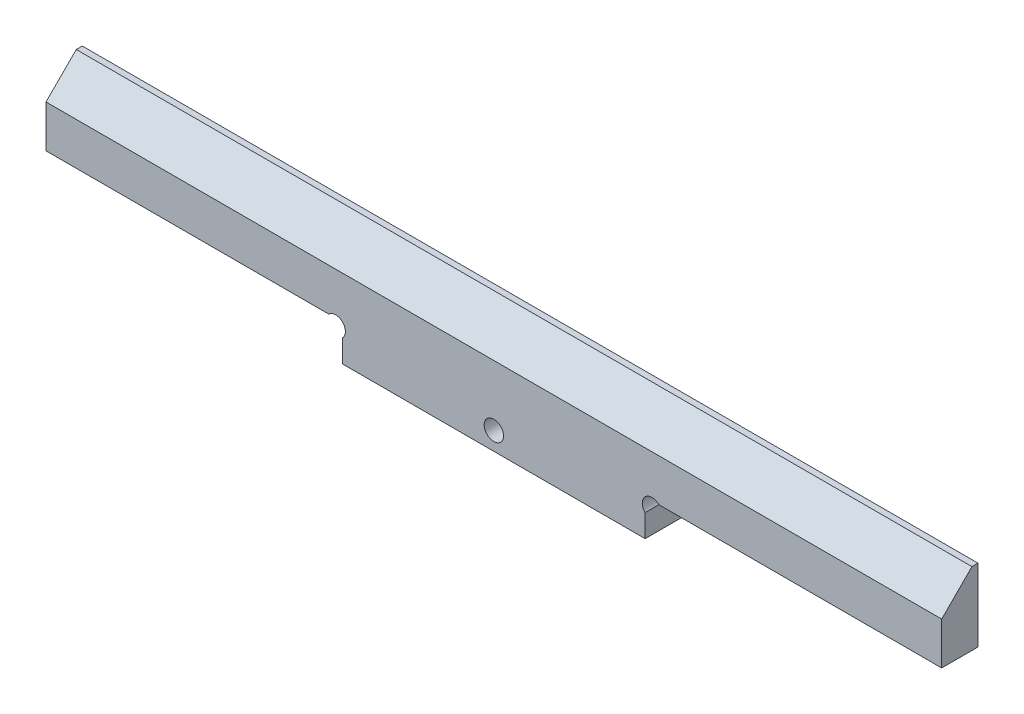
ISO-10303-21;
HEADER;
FILE_DESCRIPTION(('STEP AP214'),'2;1');
FILE_NAME('part.step','',(''),(''),'','','');
FILE_SCHEMA(('AUTOMOTIVE_DESIGN { 1 0 10303 214 1 1 1 1 }'));
ENDSEC;
DATA;
#1=APPLICATION_CONTEXT('core data for automotive mechanical design processes');
#2=APPLICATION_PROTOCOL_DEFINITION('international standard','automotive_design',2000,#1);
#3=PRODUCT_CONTEXT('',#1,'mechanical');
#4=PRODUCT('Part','Part','',(#3));
#5=PRODUCT_RELATED_PRODUCT_CATEGORY('part','',(#4));
#6=PRODUCT_DEFINITION_FORMATION('','',#4);
#7=PRODUCT_DEFINITION_CONTEXT('part definition',#1,'design');
#8=PRODUCT_DEFINITION('design','',#6,#7);
#9=PRODUCT_DEFINITION_SHAPE('','',#8);
#10=(LENGTH_UNIT() NAMED_UNIT(*) SI_UNIT(.MILLI.,.METRE.));
#11=(NAMED_UNIT(*) PLANE_ANGLE_UNIT() SI_UNIT($,.RADIAN.));
#12=(NAMED_UNIT(*) SI_UNIT($,.STERADIAN.) SOLID_ANGLE_UNIT());
#13=UNCERTAINTY_MEASURE_WITH_UNIT(LENGTH_MEASURE(1.E-05),#10,'distance_accuracy_value','');
#14=(GEOMETRIC_REPRESENTATION_CONTEXT(3) GLOBAL_UNCERTAINTY_ASSIGNED_CONTEXT((#13)) GLOBAL_UNIT_ASSIGNED_CONTEXT((#10,
#11,#12)) REPRESENTATION_CONTEXT('',''));
#15=CARTESIAN_POINT('',(0.,0.,0.));
#16=DIRECTION('',(0.,0.,1.));
#17=DIRECTION('',(1.,0.,0.));
#18=AXIS2_PLACEMENT_3D('',#15,#16,#17);
#19=CARTESIAN_POINT('',(47.8686291501015,4.86862915010152,6.));
#20=DIRECTION('',(0.,0.,1.));
#21=DIRECTION('',(1.,0.,0.));
#22=AXIS2_PLACEMENT_3D('',#19,#20,#21);
#23=PLANE('',#22);
#24=DIRECTION('',(-1.,0.,0.));
#25=VECTOR('',#24,1.);
#26=CARTESIAN_POINT('',(148.,13.,6.));
#27=LINE('',#26,#25);
#28=CARTESIAN_POINT('',(148.,13.,6.));
#29=VERTEX_POINT('',#28);
#30=CARTESIAN_POINT('',(0.,13.,6.));
#31=VERTEX_POINT('',#30);
#32=EDGE_CURVE('E216',#29,#31,#27,.T.);
#33=ORIENTED_EDGE('',*,*,#32,.T.);
#34=DIRECTION('',(0.,-1.,0.));
#35=VECTOR('',#34,1.);
#36=CARTESIAN_POINT('',(0.,6.,6.));
#37=LINE('',#36,#35);
#38=CARTESIAN_POINT('',(0.,6.,6.));
#39=VERTEX_POINT('',#38);
#40=EDGE_CURVE('E147',#31,#39,#37,.T.);
#41=ORIENTED_EDGE('',*,*,#40,.T.);
#42=DIRECTION('',(1.,0.,0.));
#43=VECTOR('',#42,1.);
#44=CARTESIAN_POINT('',(46.7372583002031,6.,6.));
#45=LINE('',#44,#43);
#46=CARTESIAN_POINT('',(46.7372583002031,6.,6.));
#47=VERTEX_POINT('',#46);
#48=EDGE_CURVE('E56',#39,#47,#45,.T.);
#49=ORIENTED_EDGE('',*,*,#48,.T.);
#50=CARTESIAN_POINT('',(47.8686291501015,4.86862915010152,6.));
#51=DIRECTION('',(0.,0.,-1.));
#52=DIRECTION('',(1.,0.,0.));
#53=AXIS2_PLACEMENT_3D('',#50,#51,#52);
#54=CIRCLE('',#53,1.6);
#55=CARTESIAN_POINT('',(49.,3.73725830020303,6.));
#56=VERTEX_POINT('',#55);
#57=EDGE_CURVE('E175',#47,#56,#54,.T.);
#58=ORIENTED_EDGE('',*,*,#57,.T.);
#59=DIRECTION('',(0.,-1.,0.));
#60=VECTOR('',#59,1.);
#61=CARTESIAN_POINT('',(49.,3.73725830020303,6.));
#62=LINE('',#61,#60);
#63=CARTESIAN_POINT('',(49.,0.,6.));
#64=VERTEX_POINT('',#63);
#65=EDGE_CURVE('E103',#56,#64,#62,.T.);
#66=ORIENTED_EDGE('',*,*,#65,.T.);
#67=DIRECTION('',(1.,0.,0.));
#68=VECTOR('',#67,1.);
#69=CARTESIAN_POINT('',(49.,0.,6.));
#70=LINE('',#69,#68);
#71=CARTESIAN_POINT('',(99.,0.,6.));
#72=VERTEX_POINT('',#71);
#73=EDGE_CURVE('E194',#64,#72,#70,.T.);
#74=ORIENTED_EDGE('',*,*,#73,.T.);
#75=DIRECTION('',(0.,1.,0.));
#76=VECTOR('',#75,1.);
#77=CARTESIAN_POINT('',(99.,0.,6.));
#78=LINE('',#77,#76);
#79=CARTESIAN_POINT('',(99.,3.73725830020303,6.));
#80=VERTEX_POINT('',#79);
#81=EDGE_CURVE('E207',#72,#80,#78,.T.);
#82=ORIENTED_EDGE('',*,*,#81,.T.);
#83=CARTESIAN_POINT('',(100.131370849898,4.86862915010152,6.));
#84=DIRECTION('',(0.,0.,-1.));
#85=DIRECTION('',(-1.,0.,0.));
#86=AXIS2_PLACEMENT_3D('',#83,#84,#85);
#87=CIRCLE('',#86,1.6);
#88=CARTESIAN_POINT('',(101.262741699797,6.,6.));
#89=VERTEX_POINT('',#88);
#90=EDGE_CURVE('E127',#80,#89,#87,.T.);
#91=ORIENTED_EDGE('',*,*,#90,.T.);
#92=DIRECTION('',(1.,0.,0.));
#93=VECTOR('',#92,1.);
#94=CARTESIAN_POINT('',(148.,6.,6.));
#95=LINE('',#94,#93);
#96=CARTESIAN_POINT('',(148.,6.,6.));
#97=VERTEX_POINT('',#96);
#98=EDGE_CURVE('E120',#89,#97,#95,.T.);
#99=ORIENTED_EDGE('',*,*,#98,.T.);
#100=DIRECTION('',(0.,1.,0.));
#101=VECTOR('',#100,1.);
#102=CARTESIAN_POINT('',(148.,18.,6.));
#103=LINE('',#102,#101);
#104=EDGE_CURVE('E125',#97,#29,#103,.T.);
#105=ORIENTED_EDGE('',*,*,#104,.T.);
#106=EDGE_LOOP('',(#33,#41,#49,#58,#66,#74,#82,#91,#99,#105));
#107=FACE_BOUND('',#106,.T.);
#108=CARTESIAN_POINT('',(74.,3.,6.));
#109=DIRECTION('',(0.,0.,1.));
#110=DIRECTION('',(1.,0.,0.));
#111=AXIS2_PLACEMENT_3D('',#108,#109,#110);
#112=CIRCLE('',#111,1.60000000000001);
#113=CARTESIAN_POINT('',(75.6,3.,6.));
#114=VERTEX_POINT('',#113);
#115=EDGE_CURVE('E158',#114,#114,#112,.T.);
#116=ORIENTED_EDGE('',*,*,#115,.F.);
#117=EDGE_LOOP('',(#116));
#118=FACE_BOUND('',#117,.T.);
#119=ADVANCED_FACE('F32',(#107,#118),#23,.T.);
#120=CARTESIAN_POINT('',(47.8686291501015,4.86862915010152,0.));
#121=DIRECTION('',(0.,0.,1.));
#122=DIRECTION('',(1.,0.,0.));
#123=AXIS2_PLACEMENT_3D('',#120,#121,#122);
#124=PLANE('',#123);
#125=CARTESIAN_POINT('',(47.8686291501015,4.86862915010152,0.));
#126=DIRECTION('',(0.,0.,-1.));
#127=DIRECTION('',(1.,0.,0.));
#128=AXIS2_PLACEMENT_3D('',#125,#126,#127);
#129=CIRCLE('',#128,1.6);
#130=CARTESIAN_POINT('',(46.7372583002031,6.,0.));
#131=VERTEX_POINT('',#130);
#132=CARTESIAN_POINT('',(49.,3.73725830020303,0.));
#133=VERTEX_POINT('',#132);
#134=EDGE_CURVE('E154',#131,#133,#129,.T.);
#135=ORIENTED_EDGE('',*,*,#134,.F.);
#136=DIRECTION('',(1.,0.,0.));
#137=VECTOR('',#136,1.);
#138=CARTESIAN_POINT('',(46.7372583002031,6.,0.));
#139=LINE('',#138,#137);
#140=CARTESIAN_POINT('',(0.,6.,0.));
#141=VERTEX_POINT('',#140);
#142=EDGE_CURVE('E95',#141,#131,#139,.T.);
#143=ORIENTED_EDGE('',*,*,#142,.F.);
#144=DIRECTION('',(0.,-1.,0.));
#145=VECTOR('',#144,1.);
#146=CARTESIAN_POINT('',(0.,6.,0.));
#147=LINE('',#146,#145);
#148=CARTESIAN_POINT('',(0.,18.,0.));
#149=VERTEX_POINT('',#148);
#150=EDGE_CURVE('E172',#149,#141,#147,.T.);
#151=ORIENTED_EDGE('',*,*,#150,.F.);
#152=DIRECTION('',(-1.,0.,0.));
#153=VECTOR('',#152,1.);
#154=CARTESIAN_POINT('',(0.,18.,0.));
#155=LINE('',#154,#153);
#156=CARTESIAN_POINT('',(148.,18.,0.));
#157=VERTEX_POINT('',#156);
#158=EDGE_CURVE('E169',#157,#149,#155,.T.);
#159=ORIENTED_EDGE('',*,*,#158,.F.);
#160=DIRECTION('',(0.,1.,0.));
#161=VECTOR('',#160,1.);
#162=CARTESIAN_POINT('',(148.,18.,0.));
#163=LINE('',#162,#161);
#164=CARTESIAN_POINT('',(148.,6.,0.));
#165=VERTEX_POINT('',#164);
#166=EDGE_CURVE('E167',#165,#157,#163,.T.);
#167=ORIENTED_EDGE('',*,*,#166,.F.);
#168=DIRECTION('',(1.,0.,0.));
#169=VECTOR('',#168,1.);
#170=CARTESIAN_POINT('',(148.,6.,0.));
#171=LINE('',#170,#169);
#172=CARTESIAN_POINT('',(101.262741699797,6.,0.));
#173=VERTEX_POINT('',#172);
#174=EDGE_CURVE('E136',#173,#165,#171,.T.);
#175=ORIENTED_EDGE('',*,*,#174,.F.);
#176=CARTESIAN_POINT('',(100.131370849898,4.86862915010152,0.));
#177=DIRECTION('',(0.,0.,-1.));
#178=DIRECTION('',(-1.,0.,0.));
#179=AXIS2_PLACEMENT_3D('',#176,#177,#178);
#180=CIRCLE('',#179,1.6);
#181=CARTESIAN_POINT('',(99.,3.73725830020303,0.));
#182=VERTEX_POINT('',#181);
#183=EDGE_CURVE('E164',#182,#173,#180,.T.);
#184=ORIENTED_EDGE('',*,*,#183,.F.);
#185=DIRECTION('',(0.,1.,0.));
#186=VECTOR('',#185,1.);
#187=CARTESIAN_POINT('',(99.,0.,0.));
#188=LINE('',#187,#186);
#189=CARTESIAN_POINT('',(99.,0.,0.));
#190=VERTEX_POINT('',#189);
#191=EDGE_CURVE('E162',#190,#182,#188,.T.);
#192=ORIENTED_EDGE('',*,*,#191,.F.);
#193=DIRECTION('',(1.,0.,0.));
#194=VECTOR('',#193,1.);
#195=CARTESIAN_POINT('',(49.,0.,0.));
#196=LINE('',#195,#194);
#197=CARTESIAN_POINT('',(49.,0.,0.));
#198=VERTEX_POINT('',#197);
#199=EDGE_CURVE('E160',#198,#190,#196,.T.);
#200=ORIENTED_EDGE('',*,*,#199,.F.);
#201=DIRECTION('',(0.,-1.,0.));
#202=VECTOR('',#201,1.);
#203=CARTESIAN_POINT('',(49.,3.73725830020303,0.));
#204=LINE('',#203,#202);
#205=EDGE_CURVE('E157',#133,#198,#204,.T.);
#206=ORIENTED_EDGE('',*,*,#205,.F.);
#207=EDGE_LOOP('',(#135,#143,#151,#159,#167,#175,#184,#192,#200,#206));
#208=FACE_BOUND('',#207,.T.);
#209=CARTESIAN_POINT('',(74.,3.,0.));
#210=DIRECTION('',(0.,0.,1.));
#211=DIRECTION('',(1.,0.,0.));
#212=AXIS2_PLACEMENT_3D('',#209,#210,#211);
#213=CIRCLE('',#212,1.60000000000001);
#214=CARTESIAN_POINT('',(75.6,3.,0.));
#215=VERTEX_POINT('',#214);
#216=EDGE_CURVE('E213',#215,#215,#213,.T.);
#217=ORIENTED_EDGE('',*,*,#216,.T.);
#218=EDGE_LOOP('',(#217));
#219=FACE_BOUND('',#218,.T.);
#220=ADVANCED_FACE('F198',(#208,#219),#124,.F.);
#221=CARTESIAN_POINT('',(47.8686291501015,4.86862915010152,6.));
#222=DIRECTION('',(0.,0.,-1.));
#223=DIRECTION('',(-1.,0.,0.));
#224=AXIS2_PLACEMENT_3D('',#221,#222,#223);
#225=CYLINDRICAL_SURFACE('',#224,1.6);
#226=ORIENTED_EDGE('',*,*,#134,.T.);
#227=DIRECTION('',(0.,0.,-1.));
#228=VECTOR('',#227,1.);
#229=CARTESIAN_POINT('',(49.,3.73725830020303,6.));
#230=LINE('',#229,#228);
#231=EDGE_CURVE('E11',#56,#133,#230,.T.);
#232=ORIENTED_EDGE('',*,*,#231,.F.);
#233=ORIENTED_EDGE('',*,*,#57,.F.);
#234=DIRECTION('',(0.,0.,-1.));
#235=VECTOR('',#234,1.);
#236=CARTESIAN_POINT('',(46.7372583002031,6.,6.));
#237=LINE('',#236,#235);
#238=EDGE_CURVE('E153',#47,#131,#237,.T.);
#239=ORIENTED_EDGE('',*,*,#238,.T.);
#240=EDGE_LOOP('',(#226,#232,#233,#239));
#241=FACE_BOUND('',#240,.T.);
#242=ADVANCED_FACE('F34',(#241),#225,.F.);
#243=CARTESIAN_POINT('',(49.,3.73725830020303,6.));
#244=DIRECTION('',(1.,0.,0.));
#245=DIRECTION('',(0.,0.,-1.));
#246=AXIS2_PLACEMENT_3D('',#243,#244,#245);
#247=PLANE('',#246);
#248=ORIENTED_EDGE('',*,*,#205,.T.);
#249=DIRECTION('',(0.,0.,-1.));
#250=VECTOR('',#249,1.);
#251=CARTESIAN_POINT('',(49.,0.,6.));
#252=LINE('',#251,#250);
#253=EDGE_CURVE('E40',#64,#198,#252,.T.);
#254=ORIENTED_EDGE('',*,*,#253,.F.);
#255=ORIENTED_EDGE('',*,*,#65,.F.);
#256=ORIENTED_EDGE('',*,*,#231,.T.);
#257=EDGE_LOOP('',(#248,#254,#255,#256));
#258=FACE_BOUND('',#257,.T.);
#259=ADVANCED_FACE('F236',(#258),#247,.F.);
#260=CARTESIAN_POINT('',(49.,0.,6.));
#261=DIRECTION('',(0.,1.,0.));
#262=DIRECTION('',(0.,0.,1.));
#263=AXIS2_PLACEMENT_3D('',#260,#261,#262);
#264=PLANE('',#263);
#265=ORIENTED_EDGE('',*,*,#199,.T.);
#266=DIRECTION('',(0.,0.,-1.));
#267=VECTOR('',#266,1.);
#268=CARTESIAN_POINT('',(99.,0.,6.));
#269=LINE('',#268,#267);
#270=EDGE_CURVE('E186',#72,#190,#269,.T.);
#271=ORIENTED_EDGE('',*,*,#270,.F.);
#272=ORIENTED_EDGE('',*,*,#73,.F.);
#273=ORIENTED_EDGE('',*,*,#253,.T.);
#274=EDGE_LOOP('',(#265,#271,#272,#273));
#275=FACE_BOUND('',#274,.T.);
#276=ADVANCED_FACE('F192',(#275),#264,.F.);
#277=CARTESIAN_POINT('',(99.,0.,6.));
#278=DIRECTION('',(-1.,0.,0.));
#279=DIRECTION('',(0.,0.,1.));
#280=AXIS2_PLACEMENT_3D('',#277,#278,#279);
#281=PLANE('',#280);
#282=ORIENTED_EDGE('',*,*,#191,.T.);
#283=DIRECTION('',(0.,0.,-1.));
#284=VECTOR('',#283,1.);
#285=CARTESIAN_POINT('',(99.,3.73725830020303,6.));
#286=LINE('',#285,#284);
#287=EDGE_CURVE('E183',#80,#182,#286,.T.);
#288=ORIENTED_EDGE('',*,*,#287,.F.);
#289=ORIENTED_EDGE('',*,*,#81,.F.);
#290=ORIENTED_EDGE('',*,*,#270,.T.);
#291=EDGE_LOOP('',(#282,#288,#289,#290));
#292=FACE_BOUND('',#291,.T.);
#293=ADVANCED_FACE('F203',(#292),#281,.F.);
#294=CARTESIAN_POINT('',(100.131370849898,4.86862915010152,6.));
#295=DIRECTION('',(0.,0.,-1.));
#296=DIRECTION('',(-1.,0.,0.));
#297=AXIS2_PLACEMENT_3D('',#294,#295,#296);
#298=CYLINDRICAL_SURFACE('',#297,1.6);
#299=ORIENTED_EDGE('',*,*,#183,.T.);
#300=DIRECTION('',(0.,0.,-1.));
#301=VECTOR('',#300,1.);
#302=CARTESIAN_POINT('',(101.262741699797,6.,6.));
#303=LINE('',#302,#301);
#304=EDGE_CURVE('E140',#89,#173,#303,.T.);
#305=ORIENTED_EDGE('',*,*,#304,.F.);
#306=ORIENTED_EDGE('',*,*,#90,.F.);
#307=ORIENTED_EDGE('',*,*,#287,.T.);
#308=EDGE_LOOP('',(#299,#305,#306,#307));
#309=FACE_BOUND('',#308,.T.);
#310=ADVANCED_FACE('F206',(#309),#298,.F.);
#311=CARTESIAN_POINT('',(148.,6.,6.));
#312=DIRECTION('',(0.,1.,0.));
#313=DIRECTION('',(-1.,0.,0.));
#314=AXIS2_PLACEMENT_3D('',#311,#312,#313);
#315=PLANE('',#314);
#316=ORIENTED_EDGE('',*,*,#174,.T.);
#317=DIRECTION('',(0.,0.,-1.));
#318=VECTOR('',#317,1.);
#319=CARTESIAN_POINT('',(148.,6.,6.));
#320=LINE('',#319,#318);
#321=EDGE_CURVE('E133',#97,#165,#320,.T.);
#322=ORIENTED_EDGE('',*,*,#321,.F.);
#323=ORIENTED_EDGE('',*,*,#98,.F.);
#324=ORIENTED_EDGE('',*,*,#304,.T.);
#325=EDGE_LOOP('',(#316,#322,#323,#324));
#326=FACE_BOUND('',#325,.T.);
#327=ADVANCED_FACE('F134',(#326),#315,.F.);
#328=CARTESIAN_POINT('',(148.,18.,6.));
#329=DIRECTION('',(-1.,0.,0.));
#330=DIRECTION('',(0.,0.,1.));
#331=AXIS2_PLACEMENT_3D('',#328,#329,#330);
#332=PLANE('',#331);
#333=DIRECTION('',(0.,0.,-1.));
#334=VECTOR('',#333,1.);
#335=CARTESIAN_POINT('',(148.,18.,6.));
#336=LINE('',#335,#334);
#337=CARTESIAN_POINT('',(148.,18.,1.));
#338=VERTEX_POINT('',#337);
#339=EDGE_CURVE('E141',#338,#157,#336,.T.);
#340=ORIENTED_EDGE('',*,*,#339,.F.);
#341=DIRECTION('',(0.,-0.707106781186546,0.707106781186549));
#342=VECTOR('',#341,1.);
#343=CARTESIAN_POINT('',(148.,18.,1.));
#344=LINE('',#343,#342);
#345=EDGE_CURVE('E146',#338,#29,#344,.T.);
#346=ORIENTED_EDGE('',*,*,#345,.T.);
#347=ORIENTED_EDGE('',*,*,#104,.F.);
#348=ORIENTED_EDGE('',*,*,#321,.T.);
#349=ORIENTED_EDGE('',*,*,#166,.T.);
#350=EDGE_LOOP('',(#340,#346,#347,#348,#349));
#351=FACE_BOUND('',#350,.T.);
#352=ADVANCED_FACE('F145',(#351),#332,.F.);
#353=CARTESIAN_POINT('',(0.,18.,6.));
#354=DIRECTION('',(0.,-1.,0.));
#355=DIRECTION('',(0.,0.,-1.));
#356=AXIS2_PLACEMENT_3D('',#353,#354,#355);
#357=PLANE('',#356);
#358=DIRECTION('',(0.,0.,-1.));
#359=VECTOR('',#358,1.);
#360=CARTESIAN_POINT('',(0.,18.,6.));
#361=LINE('',#360,#359);
#362=CARTESIAN_POINT('',(0.,18.,1.));
#363=VERTEX_POINT('',#362);
#364=EDGE_CURVE('E179',#363,#149,#361,.T.);
#365=ORIENTED_EDGE('',*,*,#364,.F.);
#366=DIRECTION('',(-1.,0.,0.));
#367=VECTOR('',#366,1.);
#368=CARTESIAN_POINT('',(148.,18.,1.));
#369=LINE('',#368,#367);
#370=EDGE_CURVE('E47',#338,#363,#369,.T.);
#371=ORIENTED_EDGE('',*,*,#370,.F.);
#372=ORIENTED_EDGE('',*,*,#339,.T.);
#373=ORIENTED_EDGE('',*,*,#158,.T.);
#374=EDGE_LOOP('',(#365,#371,#372,#373));
#375=FACE_BOUND('',#374,.T.);
#376=ADVANCED_FACE('F257',(#375),#357,.F.);
#377=CARTESIAN_POINT('',(0.,6.,6.));
#378=DIRECTION('',(1.,0.,0.));
#379=DIRECTION('',(0.,0.,-1.));
#380=AXIS2_PLACEMENT_3D('',#377,#378,#379);
#381=PLANE('',#380);
#382=ORIENTED_EDGE('',*,*,#40,.F.);
#383=DIRECTION('',(0.,-0.707106781186546,0.707106781186549));
#384=VECTOR('',#383,1.);
#385=CARTESIAN_POINT('',(0.,18.,1.));
#386=LINE('',#385,#384);
#387=EDGE_CURVE('E221',#363,#31,#386,.T.);
#388=ORIENTED_EDGE('',*,*,#387,.F.);
#389=ORIENTED_EDGE('',*,*,#364,.T.);
#390=ORIENTED_EDGE('',*,*,#150,.T.);
#391=DIRECTION('',(0.,0.,-1.));
#392=VECTOR('',#391,1.);
#393=CARTESIAN_POINT('',(0.,6.,6.));
#394=LINE('',#393,#392);
#395=EDGE_CURVE('E177',#39,#141,#394,.T.);
#396=ORIENTED_EDGE('',*,*,#395,.F.);
#397=EDGE_LOOP('',(#382,#388,#389,#390,#396));
#398=FACE_BOUND('',#397,.T.);
#399=ADVANCED_FACE('F230',(#398),#381,.F.);
#400=CARTESIAN_POINT('',(46.7372583002031,6.,6.));
#401=DIRECTION('',(0.,1.,0.));
#402=DIRECTION('',(-1.,0.,0.));
#403=AXIS2_PLACEMENT_3D('',#400,#401,#402);
#404=PLANE('',#403);
#405=ORIENTED_EDGE('',*,*,#142,.T.);
#406=ORIENTED_EDGE('',*,*,#238,.F.);
#407=ORIENTED_EDGE('',*,*,#48,.F.);
#408=ORIENTED_EDGE('',*,*,#395,.T.);
#409=EDGE_LOOP('',(#405,#406,#407,#408));
#410=FACE_BOUND('',#409,.T.);
#411=ADVANCED_FACE('F232',(#410),#404,.F.);
#412=CARTESIAN_POINT('',(74.,3.,6.));
#413=DIRECTION('',(0.,0.,-1.));
#414=DIRECTION('',(-1.,0.,0.));
#415=AXIS2_PLACEMENT_3D('',#412,#413,#414);
#416=CYLINDRICAL_SURFACE('',#415,1.60000000000001);
#417=ORIENTED_EDGE('',*,*,#115,.T.);
#418=EDGE_LOOP('',(#417));
#419=FACE_BOUND('',#418,.T.);
#420=ORIENTED_EDGE('',*,*,#216,.F.);
#421=EDGE_LOOP('',(#420));
#422=FACE_BOUND('',#421,.T.);
#423=ADVANCED_FACE('F250',(#419,#422),#416,.F.);
#424=CARTESIAN_POINT('',(148.,18.,1.));
#425=DIRECTION('',(0.,-0.707106781186549,-0.707106781186546));
#426=DIRECTION('',(0.,0.707106781186546,-0.707106781186549));
#427=AXIS2_PLACEMENT_3D('',#424,#425,#426);
#428=PLANE('',#427);
#429=ORIENTED_EDGE('',*,*,#387,.T.);
#430=ORIENTED_EDGE('',*,*,#32,.F.);
#431=ORIENTED_EDGE('',*,*,#345,.F.);
#432=ORIENTED_EDGE('',*,*,#370,.T.);
#433=EDGE_LOOP('',(#429,#430,#431,#432));
#434=FACE_BOUND('',#433,.T.);
#435=ADVANCED_FACE('F224',(#434),#428,.F.);
#436=CLOSED_SHELL('',(#119,#220,#242,#259,#276,#293,#310,#327,#352,#376,#399,#411,#423,#435));
#437=MANIFOLD_SOLID_BREP('B2',#436);
#438=ADVANCED_BREP_SHAPE_REPRESENTATION('',(#18,#437),#14);
#439=SHAPE_DEFINITION_REPRESENTATION(#9,#438);
ENDSEC;
END-ISO-10303-21;
